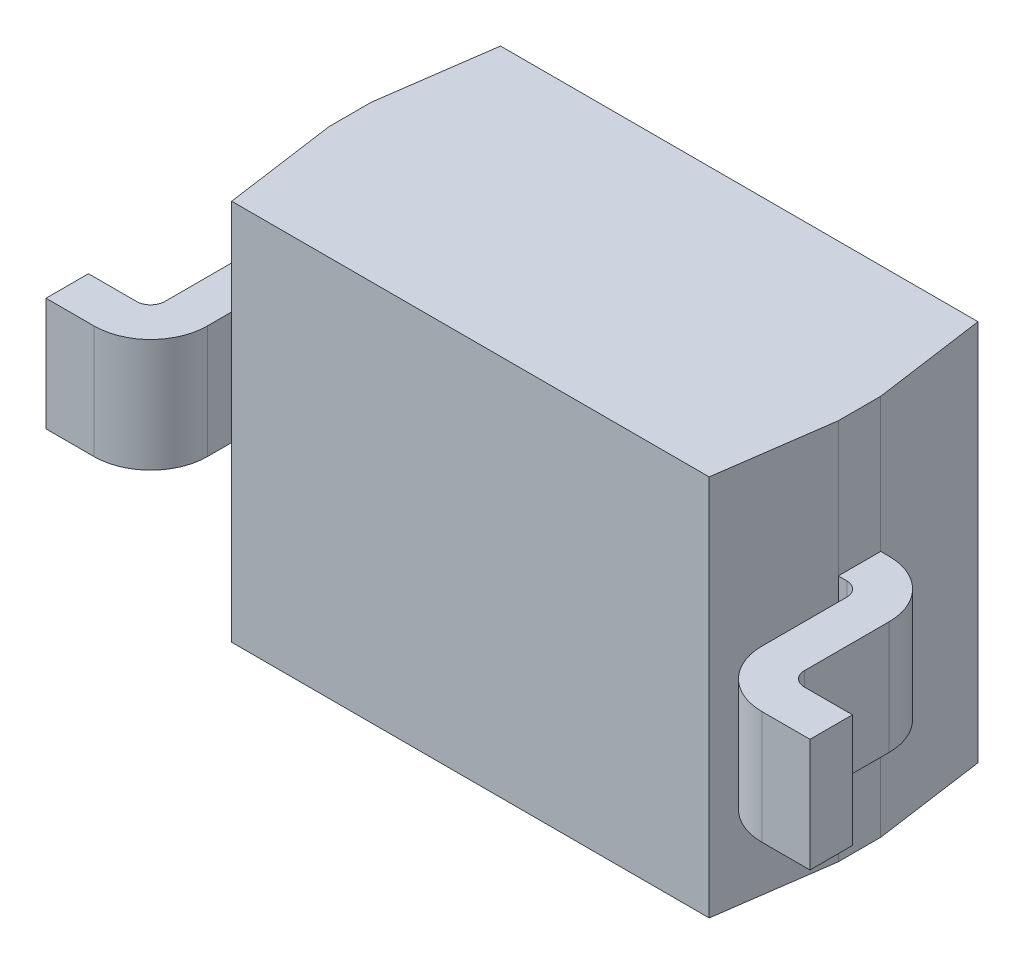
ISO-10303-21;
HEADER;
FILE_DESCRIPTION(('STEP AP214'),'2;1');
FILE_NAME('part.step','',(''),(''),'','','');
FILE_SCHEMA(('AUTOMOTIVE_DESIGN { 1 0 10303 214 1 1 1 1 }'));
ENDSEC;
DATA;
#1=APPLICATION_CONTEXT('core data for automotive mechanical design processes');
#2=APPLICATION_PROTOCOL_DEFINITION('international standard','automotive_design',2000,#1);
#3=PRODUCT_CONTEXT('',#1,'mechanical');
#4=PRODUCT('Part','Part','',(#3));
#5=PRODUCT_RELATED_PRODUCT_CATEGORY('part','',(#4));
#6=PRODUCT_DEFINITION_FORMATION('','',#4);
#7=PRODUCT_DEFINITION_CONTEXT('part definition',#1,'design');
#8=PRODUCT_DEFINITION('design','',#6,#7);
#9=PRODUCT_DEFINITION_SHAPE('','',#8);
#10=(LENGTH_UNIT() NAMED_UNIT(*) SI_UNIT(.MILLI.,.METRE.));
#11=(NAMED_UNIT(*) PLANE_ANGLE_UNIT() SI_UNIT($,.RADIAN.));
#12=(NAMED_UNIT(*) SI_UNIT($,.STERADIAN.) SOLID_ANGLE_UNIT());
#13=UNCERTAINTY_MEASURE_WITH_UNIT(LENGTH_MEASURE(1.E-05),#10,'distance_accuracy_value','');
#14=(GEOMETRIC_REPRESENTATION_CONTEXT(3) GLOBAL_UNCERTAINTY_ASSIGNED_CONTEXT((#13)) GLOBAL_UNIT_ASSIGNED_CONTEXT((#10,
#11,#12)) REPRESENTATION_CONTEXT('',''));
#15=CARTESIAN_POINT('',(0.,0.,0.));
#16=DIRECTION('',(0.,0.,1.));
#17=DIRECTION('',(1.,0.,0.));
#18=AXIS2_PLACEMENT_3D('',#15,#16,#17);
#19=CARTESIAN_POINT('',(0.871891833059522,0.,-0.9));
#20=DIRECTION('',(0.99026806874157,0.,-0.139173100960065));
#21=DIRECTION('',(0.,-1.,0.));
#22=AXIS2_PLACEMENT_3D('',#19,#20,#21);
#23=PLANE('',#22);
#24=DIRECTION('',(-0.139173100960065,0.,-0.99026806874157));
#25=VECTOR('',#24,1.);
#26=CARTESIAN_POINT('',(0.882397998537451,0.675,-0.825244748259981));
#27=LINE('',#26,#25);
#28=CARTESIAN_POINT('',(0.9,0.675,-0.7));
#29=VERTEX_POINT('',#28);
#30=CARTESIAN_POINT('',(0.843783666119044,0.675,-1.1));
#31=VERTEX_POINT('',#30);
#32=EDGE_CURVE('E58',#29,#31,#27,.T.);
#33=ORIENTED_EDGE('',*,*,#32,.F.);
#34=DIRECTION('',(0.,1.,0.));
#35=VECTOR('',#34,1.);
#36=CARTESIAN_POINT('',(0.9,0.,-0.7));
#37=LINE('',#36,#35);
#38=CARTESIAN_POINT('',(0.9,0.2,-0.7));
#39=VERTEX_POINT('',#38);
#40=EDGE_CURVE('E338',#39,#29,#37,.T.);
#41=ORIENTED_EDGE('',*,*,#40,.F.);
#42=DIRECTION('',(0.,1.,0.));
#43=VECTOR('',#42,1.);
#44=CARTESIAN_POINT('',(0.9,0.,-0.7));
#45=LINE('',#44,#43);
#46=CARTESIAN_POINT('',(0.9,-0.2,-0.7));
#47=VERTEX_POINT('',#46);
#48=EDGE_CURVE('E513',#47,#39,#45,.T.);
#49=ORIENTED_EDGE('',*,*,#48,.F.);
#50=DIRECTION('',(0.,1.,0.));
#51=VECTOR('',#50,1.);
#52=CARTESIAN_POINT('',(0.9,0.,-0.7));
#53=LINE('',#52,#51);
#54=CARTESIAN_POINT('',(0.9,-0.675,-0.7));
#55=VERTEX_POINT('',#54);
#56=EDGE_CURVE('E348',#55,#47,#53,.T.);
#57=ORIENTED_EDGE('',*,*,#56,.F.);
#58=DIRECTION('',(0.139173100960065,0.,0.99026806874157));
#59=VECTOR('',#58,1.);
#60=CARTESIAN_POINT('',(0.882397998537451,-0.675,-0.825244748259981));
#61=LINE('',#60,#59);
#62=CARTESIAN_POINT('',(0.843783666119044,-0.675,-1.1));
#63=VERTEX_POINT('',#62);
#64=EDGE_CURVE('E540',#63,#55,#61,.T.);
#65=ORIENTED_EDGE('',*,*,#64,.F.);
#66=DIRECTION('',(0.,-1.,0.));
#67=VECTOR('',#66,1.);
#68=CARTESIAN_POINT('',(0.843783666119044,0.,-1.1));
#69=LINE('',#68,#67);
#70=EDGE_CURVE('E11',#31,#63,#69,.T.);
#71=ORIENTED_EDGE('',*,*,#70,.F.);
#72=EDGE_LOOP('',(#33,#41,#49,#57,#65,#71));
#73=FACE_BOUND('',#72,.T.);
#74=ADVANCED_FACE('F47',(#73),#23,.T.);
#75=CARTESIAN_POINT('',(0.,0.,-1.1));
#76=DIRECTION('',(0.,0.,1.));
#77=DIRECTION('',(0.,-1.,0.));
#78=AXIS2_PLACEMENT_3D('',#75,#76,#77);
#79=PLANE('',#78);
#80=DIRECTION('',(0.,1.,0.));
#81=VECTOR('',#80,1.);
#82=CARTESIAN_POINT('',(-0.843783666119043,0.,-1.1));
#83=LINE('',#82,#81);
#84=CARTESIAN_POINT('',(-0.843783666119043,-0.675,-1.1));
#85=VERTEX_POINT('',#84);
#86=CARTESIAN_POINT('',(-0.843783666119043,0.675,-1.1));
#87=VERTEX_POINT('',#86);
#88=EDGE_CURVE('E450',#85,#87,#83,.T.);
#89=ORIENTED_EDGE('',*,*,#88,.T.);
#90=DIRECTION('',(1.,0.,0.));
#91=VECTOR('',#90,1.);
#92=CARTESIAN_POINT('',(0.,0.675,-1.1));
#93=LINE('',#92,#91);
#94=EDGE_CURVE('E70',#87,#31,#93,.T.);
#95=ORIENTED_EDGE('',*,*,#94,.T.);
#96=ORIENTED_EDGE('',*,*,#70,.T.);
#97=DIRECTION('',(-1.,0.,0.));
#98=VECTOR('',#97,1.);
#99=CARTESIAN_POINT('',(0.,-0.675,-1.1));
#100=LINE('',#99,#98);
#101=EDGE_CURVE('E462',#63,#85,#100,.T.);
#102=ORIENTED_EDGE('',*,*,#101,.T.);
#103=EDGE_LOOP('',(#89,#95,#96,#102));
#104=FACE_BOUND('',#103,.T.);
#105=ADVANCED_FACE('F726',(#104),#79,.F.);
#106=CARTESIAN_POINT('',(0.,0.675,-0.625));
#107=DIRECTION('',(0.,-1.,0.));
#108=DIRECTION('',(-1.,0.,0.));
#109=AXIS2_PLACEMENT_3D('',#106,#107,#108);
#110=PLANE('',#109);
#111=DIRECTION('',(0.139173100960065,0.,0.99026806874157));
#112=VECTOR('',#111,1.);
#113=CARTESIAN_POINT('',(-0.882397998537451,0.675,-0.424755251740019));
#114=LINE('',#113,#112);
#115=CARTESIAN_POINT('',(-0.9,0.675,-0.55));
#116=VERTEX_POINT('',#115);
#117=CARTESIAN_POINT('',(-0.843783666119043,0.675,-0.15));
#118=VERTEX_POINT('',#117);
#119=EDGE_CURVE('E314',#116,#118,#114,.T.);
#120=ORIENTED_EDGE('',*,*,#119,.T.);
#121=DIRECTION('',(-1.,0.,0.));
#122=VECTOR('',#121,1.);
#123=CARTESIAN_POINT('',(0.,0.675,-0.15));
#124=LINE('',#123,#122);
#125=CARTESIAN_POINT('',(0.843783666119044,0.675,-0.15));
#126=VERTEX_POINT('',#125);
#127=EDGE_CURVE('E322',#126,#118,#124,.T.);
#128=ORIENTED_EDGE('',*,*,#127,.F.);
#129=DIRECTION('',(0.139173100960065,0.,-0.99026806874157));
#130=VECTOR('',#129,1.);
#131=CARTESIAN_POINT('',(0.882397998537451,0.675,-0.424755251740019));
#132=LINE('',#131,#130);
#133=CARTESIAN_POINT('',(0.9,0.675,-0.55));
#134=VERTEX_POINT('',#133);
#135=EDGE_CURVE('E451',#126,#134,#132,.T.);
#136=ORIENTED_EDGE('',*,*,#135,.T.);
#137=DIRECTION('',(0.,0.,1.));
#138=VECTOR('',#137,1.);
#139=CARTESIAN_POINT('',(0.9,0.675,-0.625));
#140=LINE('',#139,#138);
#141=EDGE_CURVE('E344',#29,#134,#140,.T.);
#142=ORIENTED_EDGE('',*,*,#141,.F.);
#143=ORIENTED_EDGE('',*,*,#32,.T.);
#144=ORIENTED_EDGE('',*,*,#94,.F.);
#145=DIRECTION('',(-0.139173100960065,0.,0.99026806874157));
#146=VECTOR('',#145,1.);
#147=CARTESIAN_POINT('',(-0.882397998537451,0.675,-0.825244748259981));
#148=LINE('',#147,#146);
#149=CARTESIAN_POINT('',(-0.9,0.675,-0.7));
#150=VERTEX_POINT('',#149);
#151=EDGE_CURVE('E447',#87,#150,#148,.T.);
#152=ORIENTED_EDGE('',*,*,#151,.T.);
#153=DIRECTION('',(0.,0.,-1.));
#154=VECTOR('',#153,1.);
#155=CARTESIAN_POINT('',(-0.9,0.675,-0.625));
#156=LINE('',#155,#154);
#157=EDGE_CURVE('E336',#116,#150,#156,.T.);
#158=ORIENTED_EDGE('',*,*,#157,.F.);
#159=EDGE_LOOP('',(#120,#128,#136,#142,#143,#144,#152,#158));
#160=FACE_BOUND('',#159,.T.);
#161=ADVANCED_FACE('F333',(#160),#110,.F.);
#162=CARTESIAN_POINT('',(-0.871891833059522,0.,-0.9));
#163=DIRECTION('',(-0.99026806874157,0.,-0.139173100960065));
#164=DIRECTION('',(0.,1.,0.));
#165=AXIS2_PLACEMENT_3D('',#162,#163,#164);
#166=PLANE('',#165);
#167=ORIENTED_EDGE('',*,*,#151,.F.);
#168=ORIENTED_EDGE('',*,*,#88,.F.);
#169=DIRECTION('',(0.139173100960065,0.,-0.99026806874157));
#170=VECTOR('',#169,1.);
#171=CARTESIAN_POINT('',(-0.882397998537451,-0.675,-0.825244748259982));
#172=LINE('',#171,#170);
#173=CARTESIAN_POINT('',(-0.9,-0.675,-0.7));
#174=VERTEX_POINT('',#173);
#175=EDGE_CURVE('E330',#174,#85,#172,.T.);
#176=ORIENTED_EDGE('',*,*,#175,.F.);
#177=DIRECTION('',(0.,-1.,0.));
#178=VECTOR('',#177,1.);
#179=CARTESIAN_POINT('',(-0.9,0.,-0.7));
#180=LINE('',#179,#178);
#181=CARTESIAN_POINT('',(-0.9,-0.2,-0.7));
#182=VERTEX_POINT('',#181);
#183=EDGE_CURVE('E371',#182,#174,#180,.T.);
#184=ORIENTED_EDGE('',*,*,#183,.F.);
#185=DIRECTION('',(0.,-1.,0.));
#186=VECTOR('',#185,1.);
#187=CARTESIAN_POINT('',(-0.9,0.,-0.7));
#188=LINE('',#187,#186);
#189=CARTESIAN_POINT('',(-0.9,0.2,-0.7));
#190=VERTEX_POINT('',#189);
#191=EDGE_CURVE('E394',#190,#182,#188,.T.);
#192=ORIENTED_EDGE('',*,*,#191,.F.);
#193=DIRECTION('',(0.,-1.,0.));
#194=VECTOR('',#193,1.);
#195=CARTESIAN_POINT('',(-0.9,0.,-0.7));
#196=LINE('',#195,#194);
#197=EDGE_CURVE('E603',#150,#190,#196,.T.);
#198=ORIENTED_EDGE('',*,*,#197,.F.);
#199=EDGE_LOOP('',(#167,#168,#176,#184,#192,#198));
#200=FACE_BOUND('',#199,.T.);
#201=ADVANCED_FACE('F784',(#200),#166,.T.);
#202=CARTESIAN_POINT('',(0.871891833059522,0.,-0.35));
#203=DIRECTION('',(0.99026806874157,0.,0.139173100960065));
#204=DIRECTION('',(0.,-1.,0.));
#205=AXIS2_PLACEMENT_3D('',#202,#203,#204);
#206=PLANE('',#205);
#207=ORIENTED_EDGE('',*,*,#135,.F.);
#208=DIRECTION('',(0.,1.,0.));
#209=VECTOR('',#208,1.);
#210=CARTESIAN_POINT('',(0.843783666119044,0.,-0.15));
#211=LINE('',#210,#209);
#212=CARTESIAN_POINT('',(0.843783666119044,-0.675,-0.15));
#213=VERTEX_POINT('',#212);
#214=EDGE_CURVE('E325',#213,#126,#211,.T.);
#215=ORIENTED_EDGE('',*,*,#214,.F.);
#216=DIRECTION('',(-0.139173100960065,0.,0.99026806874157));
#217=VECTOR('',#216,1.);
#218=CARTESIAN_POINT('',(0.882397998537451,-0.675,-0.424755251740019));
#219=LINE('',#218,#217);
#220=CARTESIAN_POINT('',(0.9,-0.675,-0.55));
#221=VERTEX_POINT('',#220);
#222=EDGE_CURVE('E475',#221,#213,#219,.T.);
#223=ORIENTED_EDGE('',*,*,#222,.F.);
#224=DIRECTION('',(0.,-1.,0.));
#225=VECTOR('',#224,1.);
#226=CARTESIAN_POINT('',(0.9,0.,-0.55));
#227=LINE('',#226,#225);
#228=CARTESIAN_POINT('',(0.9,-0.2,-0.55));
#229=VERTEX_POINT('',#228);
#230=EDGE_CURVE('E472',#229,#221,#227,.T.);
#231=ORIENTED_EDGE('',*,*,#230,.F.);
#232=DIRECTION('',(0.,-1.,0.));
#233=VECTOR('',#232,1.);
#234=CARTESIAN_POINT('',(0.9,0.,-0.55));
#235=LINE('',#234,#233);
#236=CARTESIAN_POINT('',(0.9,0.2,-0.55));
#237=VERTEX_POINT('',#236);
#238=EDGE_CURVE('E359',#237,#229,#235,.T.);
#239=ORIENTED_EDGE('',*,*,#238,.F.);
#240=DIRECTION('',(0.,-1.,0.));
#241=VECTOR('',#240,1.);
#242=CARTESIAN_POINT('',(0.9,0.,-0.55));
#243=LINE('',#242,#241);
#244=EDGE_CURVE('E468',#134,#237,#243,.T.);
#245=ORIENTED_EDGE('',*,*,#244,.F.);
#246=EDGE_LOOP('',(#207,#215,#223,#231,#239,#245));
#247=FACE_BOUND('',#246,.T.);
#248=ADVANCED_FACE('F690',(#247),#206,.T.);
#249=CARTESIAN_POINT('',(0.,0.,-0.15));
#250=DIRECTION('',(0.,0.,-1.));
#251=DIRECTION('',(0.,-1.,0.));
#252=AXIS2_PLACEMENT_3D('',#249,#250,#251);
#253=PLANE('',#252);
#254=DIRECTION('',(0.,-1.,0.));
#255=VECTOR('',#254,1.);
#256=CARTESIAN_POINT('',(-0.843783666119043,0.,-0.15));
#257=LINE('',#256,#255);
#258=CARTESIAN_POINT('',(-0.843783666119043,-0.675,-0.15));
#259=VERTEX_POINT('',#258);
#260=EDGE_CURVE('E309',#118,#259,#257,.T.);
#261=ORIENTED_EDGE('',*,*,#260,.T.);
#262=DIRECTION('',(1.,0.,0.));
#263=VECTOR('',#262,1.);
#264=CARTESIAN_POINT('',(0.,-0.675,-0.15));
#265=LINE('',#264,#263);
#266=EDGE_CURVE('E473',#259,#213,#265,.T.);
#267=ORIENTED_EDGE('',*,*,#266,.T.);
#268=ORIENTED_EDGE('',*,*,#214,.T.);
#269=ORIENTED_EDGE('',*,*,#127,.T.);
#270=EDGE_LOOP('',(#261,#267,#268,#269));
#271=FACE_BOUND('',#270,.T.);
#272=ADVANCED_FACE('F323',(#271),#253,.F.);
#273=CARTESIAN_POINT('',(0.,-0.675,-0.625));
#274=DIRECTION('',(0.,-1.,0.));
#275=DIRECTION('',(-1.,0.,0.));
#276=AXIS2_PLACEMENT_3D('',#273,#274,#275);
#277=PLANE('',#276);
#278=DIRECTION('',(-0.139173100960065,0.,-0.99026806874157));
#279=VECTOR('',#278,1.);
#280=CARTESIAN_POINT('',(-0.882397998537451,-0.675,-0.424755251740019));
#281=LINE('',#280,#279);
#282=CARTESIAN_POINT('',(-0.9,-0.675,-0.55));
#283=VERTEX_POINT('',#282);
#284=EDGE_CURVE('E316',#259,#283,#281,.T.);
#285=ORIENTED_EDGE('',*,*,#284,.T.);
#286=DIRECTION('',(0.,0.,1.));
#287=VECTOR('',#286,1.);
#288=CARTESIAN_POINT('',(-0.9,-0.675,-0.625));
#289=LINE('',#288,#287);
#290=EDGE_CURVE('E367',#174,#283,#289,.T.);
#291=ORIENTED_EDGE('',*,*,#290,.F.);
#292=ORIENTED_EDGE('',*,*,#175,.T.);
#293=ORIENTED_EDGE('',*,*,#101,.F.);
#294=ORIENTED_EDGE('',*,*,#64,.T.);
#295=DIRECTION('',(0.,0.,-1.));
#296=VECTOR('',#295,1.);
#297=CARTESIAN_POINT('',(0.9,-0.675,-0.625));
#298=LINE('',#297,#296);
#299=EDGE_CURVE('E525',#221,#55,#298,.T.);
#300=ORIENTED_EDGE('',*,*,#299,.F.);
#301=ORIENTED_EDGE('',*,*,#222,.T.);
#302=ORIENTED_EDGE('',*,*,#266,.F.);
#303=EDGE_LOOP('',(#285,#291,#292,#293,#294,#300,#301,#302));
#304=FACE_BOUND('',#303,.T.);
#305=ADVANCED_FACE('F686',(#304),#277,.T.);
#306=CARTESIAN_POINT('',(-0.871891833059522,0.,-0.35));
#307=DIRECTION('',(-0.99026806874157,0.,0.139173100960065));
#308=DIRECTION('',(-0.139173100960065,0.,-0.99026806874157));
#309=AXIS2_PLACEMENT_3D('',#306,#307,#308);
#310=PLANE('',#309);
#311=ORIENTED_EDGE('',*,*,#119,.F.);
#312=DIRECTION('',(0.,1.,0.));
#313=VECTOR('',#312,1.);
#314=CARTESIAN_POINT('',(-0.9,0.,-0.55));
#315=LINE('',#314,#313);
#316=CARTESIAN_POINT('',(-0.9,0.2,-0.55));
#317=VERTEX_POINT('',#316);
#318=EDGE_CURVE('E572',#317,#116,#315,.T.);
#319=ORIENTED_EDGE('',*,*,#318,.F.);
#320=DIRECTION('',(0.,1.,0.));
#321=VECTOR('',#320,1.);
#322=CARTESIAN_POINT('',(-0.9,0.,-0.55));
#323=LINE('',#322,#321);
#324=CARTESIAN_POINT('',(-0.9,-0.2,-0.55));
#325=VERTEX_POINT('',#324);
#326=EDGE_CURVE('E446',#325,#317,#323,.T.);
#327=ORIENTED_EDGE('',*,*,#326,.F.);
#328=DIRECTION('',(0.,1.,0.));
#329=VECTOR('',#328,1.);
#330=CARTESIAN_POINT('',(-0.9,0.,-0.55));
#331=LINE('',#330,#329);
#332=EDGE_CURVE('E372',#283,#325,#331,.T.);
#333=ORIENTED_EDGE('',*,*,#332,.F.);
#334=ORIENTED_EDGE('',*,*,#284,.F.);
#335=ORIENTED_EDGE('',*,*,#260,.F.);
#336=EDGE_LOOP('',(#311,#319,#327,#333,#334,#335));
#337=FACE_BOUND('',#336,.T.);
#338=ADVANCED_FACE('F311',(#337),#310,.T.);
#339=CARTESIAN_POINT('',(0.9,0.,-0.625));
#340=DIRECTION('',(-1.,0.,0.));
#341=DIRECTION('',(0.,0.,-1.));
#342=AXIS2_PLACEMENT_3D('',#339,#340,#341);
#343=PLANE('',#342);
#344=DIRECTION('',(0.,0.,1.));
#345=VECTOR('',#344,1.);
#346=CARTESIAN_POINT('',(0.9,0.2,-0.6625));
#347=LINE('',#346,#345);
#348=EDGE_CURVE('E480',#39,#237,#347,.T.);
#349=ORIENTED_EDGE('',*,*,#348,.F.);
#350=ORIENTED_EDGE('',*,*,#40,.T.);
#351=ORIENTED_EDGE('',*,*,#141,.T.);
#352=ORIENTED_EDGE('',*,*,#244,.T.);
#353=EDGE_LOOP('',(#349,#350,#351,#352));
#354=FACE_BOUND('',#353,.T.);
#355=ADVANCED_FACE('F753',(#354),#343,.F.);
#356=CARTESIAN_POINT('',(0.9,0.,-0.625));
#357=DIRECTION('',(-1.,0.,0.));
#358=DIRECTION('',(0.,0.,-1.));
#359=AXIS2_PLACEMENT_3D('',#356,#357,#358);
#360=PLANE('',#359);
#361=DIRECTION('',(0.,0.,-1.));
#362=VECTOR('',#361,1.);
#363=CARTESIAN_POINT('',(0.9,-0.2,-0.6625));
#364=LINE('',#363,#362);
#365=EDGE_CURVE('E502',#229,#47,#364,.T.);
#366=ORIENTED_EDGE('',*,*,#365,.F.);
#367=ORIENTED_EDGE('',*,*,#230,.T.);
#368=ORIENTED_EDGE('',*,*,#299,.T.);
#369=ORIENTED_EDGE('',*,*,#56,.T.);
#370=EDGE_LOOP('',(#366,#367,#368,#369));
#371=FACE_BOUND('',#370,.T.);
#372=ADVANCED_FACE('F755',(#371),#360,.F.);
#373=CARTESIAN_POINT('',(0.9,-0.2,-0.7));
#374=DIRECTION('',(0.,1.,0.));
#375=DIRECTION('',(0.,0.,1.));
#376=AXIS2_PLACEMENT_3D('',#373,#374,#375);
#377=PLANE('',#376);
#378=ORIENTED_EDGE('',*,*,#365,.T.);
#379=DIRECTION('',(-1.,0.,0.));
#380=VECTOR('',#379,1.);
#381=CARTESIAN_POINT('',(0.9,-0.2,-0.7));
#382=LINE('',#381,#380);
#383=CARTESIAN_POINT('',(0.93,-0.2,-0.7));
#384=VERTEX_POINT('',#383);
#385=EDGE_CURVE('E419',#384,#47,#382,.T.);
#386=ORIENTED_EDGE('',*,*,#385,.F.);
#387=CARTESIAN_POINT('',(0.93,-0.2,-0.5));
#388=DIRECTION('',(0.,1.,0.));
#389=DIRECTION('',(1.,0.,0.));
#390=AXIS2_PLACEMENT_3D('',#387,#388,#389);
#391=CIRCLE('',#390,0.2);
#392=CARTESIAN_POINT('',(1.13,-0.2,-0.5));
#393=VERTEX_POINT('',#392);
#394=EDGE_CURVE('E373',#393,#384,#391,.T.);
#395=ORIENTED_EDGE('',*,*,#394,.F.);
#396=DIRECTION('',(0.,0.,-1.));
#397=VECTOR('',#396,1.);
#398=CARTESIAN_POINT('',(1.13,-0.2,-0.5));
#399=LINE('',#398,#397);
#400=CARTESIAN_POINT('',(1.13,-0.2,-0.2));
#401=VERTEX_POINT('',#400);
#402=EDGE_CURVE('E532',#401,#393,#399,.T.);
#403=ORIENTED_EDGE('',*,*,#402,.F.);
#404=CARTESIAN_POINT('',(1.18,-0.2,-0.2));
#405=DIRECTION('',(0.,-1.,0.));
#406=DIRECTION('',(1.,0.,0.));
#407=AXIS2_PLACEMENT_3D('',#404,#405,#406);
#408=CIRCLE('',#407,0.05);
#409=CARTESIAN_POINT('',(1.18,-0.2,-0.15));
#410=VERTEX_POINT('',#409);
#411=EDGE_CURVE('E463',#410,#401,#408,.T.);
#412=ORIENTED_EDGE('',*,*,#411,.F.);
#413=DIRECTION('',(-1.,0.,0.));
#414=VECTOR('',#413,1.);
#415=CARTESIAN_POINT('',(1.18,-0.2,-0.15));
#416=LINE('',#415,#414);
#417=CARTESIAN_POINT('',(1.35,-0.2,-0.15));
#418=VERTEX_POINT('',#417);
#419=EDGE_CURVE('E350',#418,#410,#416,.T.);
#420=ORIENTED_EDGE('',*,*,#419,.F.);
#421=DIRECTION('',(0.,0.,-1.));
#422=VECTOR('',#421,1.);
#423=CARTESIAN_POINT('',(1.35,-0.2,-0.15));
#424=LINE('',#423,#422);
#425=CARTESIAN_POINT('',(1.35,-0.2,0.));
#426=VERTEX_POINT('',#425);
#427=EDGE_CURVE('E366',#426,#418,#424,.T.);
#428=ORIENTED_EDGE('',*,*,#427,.F.);
#429=DIRECTION('',(1.,0.,0.));
#430=VECTOR('',#429,1.);
#431=CARTESIAN_POINT('',(1.35,-0.2,0.));
#432=LINE('',#431,#430);
#433=CARTESIAN_POINT('',(1.18,-0.2,0.));
#434=VERTEX_POINT('',#433);
#435=EDGE_CURVE('E576',#434,#426,#432,.T.);
#436=ORIENTED_EDGE('',*,*,#435,.F.);
#437=CARTESIAN_POINT('',(1.18,-0.2,-0.2));
#438=DIRECTION('',(0.,1.,0.));
#439=DIRECTION('',(1.,0.,0.));
#440=AXIS2_PLACEMENT_3D('',#437,#438,#439);
#441=CIRCLE('',#440,0.2);
#442=CARTESIAN_POINT('',(0.98,-0.2,-0.2));
#443=VERTEX_POINT('',#442);
#444=EDGE_CURVE('E560',#443,#434,#441,.T.);
#445=ORIENTED_EDGE('',*,*,#444,.F.);
#446=DIRECTION('',(0.,0.,1.));
#447=VECTOR('',#446,1.);
#448=CARTESIAN_POINT('',(0.98,-0.2,-0.2));
#449=LINE('',#448,#447);
#450=CARTESIAN_POINT('',(0.98,-0.2,-0.5));
#451=VERTEX_POINT('',#450);
#452=EDGE_CURVE('E443',#451,#443,#449,.T.);
#453=ORIENTED_EDGE('',*,*,#452,.F.);
#454=CARTESIAN_POINT('',(0.93,-0.2,-0.5));
#455=DIRECTION('',(0.,-1.,0.));
#456=DIRECTION('',(1.,0.,0.));
#457=AXIS2_PLACEMENT_3D('',#454,#455,#456);
#458=CIRCLE('',#457,0.05);
#459=CARTESIAN_POINT('',(0.93,-0.2,-0.55));
#460=VERTEX_POINT('',#459);
#461=EDGE_CURVE('E485',#460,#451,#458,.T.);
#462=ORIENTED_EDGE('',*,*,#461,.F.);
#463=DIRECTION('',(1.,0.,0.));
#464=VECTOR('',#463,1.);
#465=CARTESIAN_POINT('',(0.93,-0.2,-0.55));
#466=LINE('',#465,#464);
#467=EDGE_CURVE('E356',#229,#460,#466,.T.);
#468=ORIENTED_EDGE('',*,*,#467,.F.);
#469=EDGE_LOOP('',(#378,#386,#395,#403,#412,#420,#428,#436,#445,#453,#462,#468));
#470=FACE_BOUND('',#469,.T.);
#471=ADVANCED_FACE('F796',(#470),#377,.F.);
#472=CARTESIAN_POINT('',(0.9,0.2,-0.7));
#473=DIRECTION('',(0.,1.,0.));
#474=DIRECTION('',(0.,0.,1.));
#475=AXIS2_PLACEMENT_3D('',#472,#473,#474);
#476=PLANE('',#475);
#477=ORIENTED_EDGE('',*,*,#348,.T.);
#478=DIRECTION('',(-1.,0.,0.));
#479=VECTOR('',#478,1.);
#480=CARTESIAN_POINT('',(0.93,0.2,-0.55));
#481=LINE('',#480,#479);
#482=CARTESIAN_POINT('',(0.93,0.2,-0.55));
#483=VERTEX_POINT('',#482);
#484=EDGE_CURVE('E360',#483,#237,#481,.T.);
#485=ORIENTED_EDGE('',*,*,#484,.F.);
#486=CARTESIAN_POINT('',(0.93,0.2,-0.5));
#487=DIRECTION('',(0.,1.,0.));
#488=DIRECTION('',(1.,0.,0.));
#489=AXIS2_PLACEMENT_3D('',#486,#487,#488);
#490=CIRCLE('',#489,0.05);
#491=CARTESIAN_POINT('',(0.98,0.2,-0.5));
#492=VERTEX_POINT('',#491);
#493=EDGE_CURVE('E442',#492,#483,#490,.T.);
#494=ORIENTED_EDGE('',*,*,#493,.F.);
#495=DIRECTION('',(0.,0.,-1.));
#496=VECTOR('',#495,1.);
#497=CARTESIAN_POINT('',(0.98,0.2,-0.2));
#498=LINE('',#497,#496);
#499=CARTESIAN_POINT('',(0.98,0.2,-0.2));
#500=VERTEX_POINT('',#499);
#501=EDGE_CURVE('E623',#500,#492,#498,.T.);
#502=ORIENTED_EDGE('',*,*,#501,.F.);
#503=CARTESIAN_POINT('',(1.18,0.2,-0.2));
#504=DIRECTION('',(0.,-1.,0.));
#505=DIRECTION('',(1.,0.,0.));
#506=AXIS2_PLACEMENT_3D('',#503,#504,#505);
#507=CIRCLE('',#506,0.2);
#508=CARTESIAN_POINT('',(1.18,0.2,0.));
#509=VERTEX_POINT('',#508);
#510=EDGE_CURVE('E565',#509,#500,#507,.T.);
#511=ORIENTED_EDGE('',*,*,#510,.F.);
#512=DIRECTION('',(-1.,0.,0.));
#513=VECTOR('',#512,1.);
#514=CARTESIAN_POINT('',(1.35,0.2,0.));
#515=LINE('',#514,#513);
#516=CARTESIAN_POINT('',(1.35,0.2,0.));
#517=VERTEX_POINT('',#516);
#518=EDGE_CURVE('E586',#517,#509,#515,.T.);
#519=ORIENTED_EDGE('',*,*,#518,.F.);
#520=DIRECTION('',(0.,0.,1.));
#521=VECTOR('',#520,1.);
#522=CARTESIAN_POINT('',(1.35,0.2,-0.15));
#523=LINE('',#522,#521);
#524=CARTESIAN_POINT('',(1.35,0.2,-0.15));
#525=VERTEX_POINT('',#524);
#526=EDGE_CURVE('E362',#525,#517,#523,.T.);
#527=ORIENTED_EDGE('',*,*,#526,.F.);
#528=DIRECTION('',(1.,0.,0.));
#529=VECTOR('',#528,1.);
#530=CARTESIAN_POINT('',(1.18,0.2,-0.15));
#531=LINE('',#530,#529);
#532=CARTESIAN_POINT('',(1.18,0.2,-0.15));
#533=VERTEX_POINT('',#532);
#534=EDGE_CURVE('E355',#533,#525,#531,.T.);
#535=ORIENTED_EDGE('',*,*,#534,.F.);
#536=CARTESIAN_POINT('',(1.18,0.2,-0.2));
#537=DIRECTION('',(0.,1.,0.));
#538=DIRECTION('',(1.,0.,0.));
#539=AXIS2_PLACEMENT_3D('',#536,#537,#538);
#540=CIRCLE('',#539,0.05);
#541=CARTESIAN_POINT('',(1.13,0.2,-0.2));
#542=VERTEX_POINT('',#541);
#543=EDGE_CURVE('E467',#542,#533,#540,.T.);
#544=ORIENTED_EDGE('',*,*,#543,.F.);
#545=DIRECTION('',(0.,0.,1.));
#546=VECTOR('',#545,1.);
#547=CARTESIAN_POINT('',(1.13,0.2,-0.5));
#548=LINE('',#547,#546);
#549=CARTESIAN_POINT('',(1.13,0.2,-0.5));
#550=VERTEX_POINT('',#549);
#551=EDGE_CURVE('E524',#550,#542,#548,.T.);
#552=ORIENTED_EDGE('',*,*,#551,.F.);
#553=CARTESIAN_POINT('',(0.93,0.2,-0.5));
#554=DIRECTION('',(0.,-1.,0.));
#555=DIRECTION('',(1.,0.,0.));
#556=AXIS2_PLACEMENT_3D('',#553,#554,#555);
#557=CIRCLE('',#556,0.2);
#558=CARTESIAN_POINT('',(0.93,0.2,-0.7));
#559=VERTEX_POINT('',#558);
#560=EDGE_CURVE('E378',#559,#550,#557,.T.);
#561=ORIENTED_EDGE('',*,*,#560,.F.);
#562=DIRECTION('',(1.,0.,0.));
#563=VECTOR('',#562,1.);
#564=CARTESIAN_POINT('',(0.9,0.2,-0.7));
#565=LINE('',#564,#563);
#566=EDGE_CURVE('E510',#39,#559,#565,.T.);
#567=ORIENTED_EDGE('',*,*,#566,.F.);
#568=EDGE_LOOP('',(#477,#485,#494,#502,#511,#519,#527,#535,#544,#552,#561,#567));
#569=FACE_BOUND('',#568,.T.);
#570=ADVANCED_FACE('F799',(#569),#476,.T.);
#571=CARTESIAN_POINT('',(0.9,0.2,-0.55));
#572=DIRECTION('',(0.,0.,1.));
#573=DIRECTION('',(0.,-1.,0.));
#574=AXIS2_PLACEMENT_3D('',#571,#572,#573);
#575=PLANE('',#574);
#576=ORIENTED_EDGE('',*,*,#484,.T.);
#577=ORIENTED_EDGE('',*,*,#238,.T.);
#578=ORIENTED_EDGE('',*,*,#467,.T.);
#579=DIRECTION('',(0.,-1.,0.));
#580=VECTOR('',#579,1.);
#581=CARTESIAN_POINT('',(0.93,0.2,-0.55));
#582=LINE('',#581,#580);
#583=EDGE_CURVE('E489',#483,#460,#582,.T.);
#584=ORIENTED_EDGE('',*,*,#583,.F.);
#585=EDGE_LOOP('',(#576,#577,#578,#584));
#586=FACE_BOUND('',#585,.T.);
#587=ADVANCED_FACE('F780',(#586),#575,.T.);
#588=CARTESIAN_POINT('',(0.93,0.2,-0.5));
#589=DIRECTION('',(0.,-1.,0.));
#590=DIRECTION('',(1.,0.,0.));
#591=AXIS2_PLACEMENT_3D('',#588,#589,#590);
#592=CYLINDRICAL_SURFACE('',#591,0.05);
#593=ORIENTED_EDGE('',*,*,#493,.T.);
#594=ORIENTED_EDGE('',*,*,#583,.T.);
#595=ORIENTED_EDGE('',*,*,#461,.T.);
#596=DIRECTION('',(0.,-1.,0.));
#597=VECTOR('',#596,1.);
#598=CARTESIAN_POINT('',(0.98,0.2,-0.5));
#599=LINE('',#598,#597);
#600=EDGE_CURVE('E438',#492,#451,#599,.T.);
#601=ORIENTED_EDGE('',*,*,#600,.F.);
#602=EDGE_LOOP('',(#593,#594,#595,#601));
#603=FACE_BOUND('',#602,.T.);
#604=ADVANCED_FACE('F763',(#603),#592,.F.);
#605=CARTESIAN_POINT('',(0.98,0.2,-0.5));
#606=DIRECTION('',(-1.,0.,0.));
#607=DIRECTION('',(0.,0.,-1.));
#608=AXIS2_PLACEMENT_3D('',#605,#606,#607);
#609=PLANE('',#608);
#610=ORIENTED_EDGE('',*,*,#501,.T.);
#611=ORIENTED_EDGE('',*,*,#600,.T.);
#612=ORIENTED_EDGE('',*,*,#452,.T.);
#613=DIRECTION('',(0.,-1.,0.));
#614=VECTOR('',#613,1.);
#615=CARTESIAN_POINT('',(0.98,0.2,-0.2));
#616=LINE('',#615,#614);
#617=EDGE_CURVE('E564',#500,#443,#616,.T.);
#618=ORIENTED_EDGE('',*,*,#617,.F.);
#619=EDGE_LOOP('',(#610,#611,#612,#618));
#620=FACE_BOUND('',#619,.T.);
#621=ADVANCED_FACE('F759',(#620),#609,.T.);
#622=CARTESIAN_POINT('',(1.18,0.2,-0.2));
#623=DIRECTION('',(0.,-1.,0.));
#624=DIRECTION('',(1.,0.,0.));
#625=AXIS2_PLACEMENT_3D('',#622,#623,#624);
#626=CYLINDRICAL_SURFACE('',#625,0.2);
#627=ORIENTED_EDGE('',*,*,#510,.T.);
#628=ORIENTED_EDGE('',*,*,#617,.T.);
#629=ORIENTED_EDGE('',*,*,#444,.T.);
#630=DIRECTION('',(0.,-1.,0.));
#631=VECTOR('',#630,1.);
#632=CARTESIAN_POINT('',(1.18,0.2,0.));
#633=LINE('',#632,#631);
#634=EDGE_CURVE('E573',#509,#434,#633,.T.);
#635=ORIENTED_EDGE('',*,*,#634,.F.);
#636=EDGE_LOOP('',(#627,#628,#629,#635));
#637=FACE_BOUND('',#636,.T.);
#638=ADVANCED_FACE('F762',(#637),#626,.T.);
#639=CARTESIAN_POINT('',(1.18,0.2,0.));
#640=DIRECTION('',(0.,0.,1.));
#641=DIRECTION('',(0.,-1.,0.));
#642=AXIS2_PLACEMENT_3D('',#639,#640,#641);
#643=PLANE('',#642);
#644=ORIENTED_EDGE('',*,*,#518,.T.);
#645=ORIENTED_EDGE('',*,*,#634,.T.);
#646=ORIENTED_EDGE('',*,*,#435,.T.);
#647=DIRECTION('',(0.,-1.,0.));
#648=VECTOR('',#647,1.);
#649=CARTESIAN_POINT('',(1.35,0.2,0.));
#650=LINE('',#649,#648);
#651=EDGE_CURVE('E583',#517,#426,#650,.T.);
#652=ORIENTED_EDGE('',*,*,#651,.F.);
#653=EDGE_LOOP('',(#644,#645,#646,#652));
#654=FACE_BOUND('',#653,.T.);
#655=ADVANCED_FACE('F751',(#654),#643,.T.);
#656=CARTESIAN_POINT('',(1.35,0.2,0.));
#657=DIRECTION('',(1.,0.,0.));
#658=DIRECTION('',(0.,1.,0.));
#659=AXIS2_PLACEMENT_3D('',#656,#657,#658);
#660=PLANE('',#659);
#661=ORIENTED_EDGE('',*,*,#526,.T.);
#662=ORIENTED_EDGE('',*,*,#651,.T.);
#663=ORIENTED_EDGE('',*,*,#427,.T.);
#664=DIRECTION('',(0.,-1.,0.));
#665=VECTOR('',#664,1.);
#666=CARTESIAN_POINT('',(1.35,0.2,-0.15));
#667=LINE('',#666,#665);
#668=EDGE_CURVE('E354',#525,#418,#667,.T.);
#669=ORIENTED_EDGE('',*,*,#668,.F.);
#670=EDGE_LOOP('',(#661,#662,#663,#669));
#671=FACE_BOUND('',#670,.T.);
#672=ADVANCED_FACE('F748',(#671),#660,.T.);
#673=CARTESIAN_POINT('',(1.35,0.2,-0.15));
#674=DIRECTION('',(0.,0.,-1.));
#675=DIRECTION('',(0.,-1.,0.));
#676=AXIS2_PLACEMENT_3D('',#673,#674,#675);
#677=PLANE('',#676);
#678=ORIENTED_EDGE('',*,*,#534,.T.);
#679=ORIENTED_EDGE('',*,*,#668,.T.);
#680=ORIENTED_EDGE('',*,*,#419,.T.);
#681=DIRECTION('',(0.,-1.,0.));
#682=VECTOR('',#681,1.);
#683=CARTESIAN_POINT('',(1.18,0.2,-0.15));
#684=LINE('',#683,#682);
#685=EDGE_CURVE('E429',#533,#410,#684,.T.);
#686=ORIENTED_EDGE('',*,*,#685,.F.);
#687=EDGE_LOOP('',(#678,#679,#680,#686));
#688=FACE_BOUND('',#687,.T.);
#689=ADVANCED_FACE('F738',(#688),#677,.T.);
#690=CARTESIAN_POINT('',(1.18,0.2,-0.2));
#691=DIRECTION('',(0.,-1.,0.));
#692=DIRECTION('',(1.,0.,0.));
#693=AXIS2_PLACEMENT_3D('',#690,#691,#692);
#694=CYLINDRICAL_SURFACE('',#693,0.05);
#695=ORIENTED_EDGE('',*,*,#543,.T.);
#696=ORIENTED_EDGE('',*,*,#685,.T.);
#697=ORIENTED_EDGE('',*,*,#411,.T.);
#698=DIRECTION('',(0.,-1.,0.));
#699=VECTOR('',#698,1.);
#700=CARTESIAN_POINT('',(1.13,0.2,-0.2));
#701=LINE('',#700,#699);
#702=EDGE_CURVE('E536',#542,#401,#701,.T.);
#703=ORIENTED_EDGE('',*,*,#702,.F.);
#704=EDGE_LOOP('',(#695,#696,#697,#703));
#705=FACE_BOUND('',#704,.T.);
#706=ADVANCED_FACE('F746',(#705),#694,.F.);
#707=CARTESIAN_POINT('',(1.13,0.2,-0.2));
#708=DIRECTION('',(1.,0.,0.));
#709=DIRECTION('',(0.,1.,0.));
#710=AXIS2_PLACEMENT_3D('',#707,#708,#709);
#711=PLANE('',#710);
#712=ORIENTED_EDGE('',*,*,#551,.T.);
#713=ORIENTED_EDGE('',*,*,#702,.T.);
#714=ORIENTED_EDGE('',*,*,#402,.T.);
#715=DIRECTION('',(0.,-1.,0.));
#716=VECTOR('',#715,1.);
#717=CARTESIAN_POINT('',(1.13,0.2,-0.5));
#718=LINE('',#717,#716);
#719=EDGE_CURVE('E377',#550,#393,#718,.T.);
#720=ORIENTED_EDGE('',*,*,#719,.F.);
#721=EDGE_LOOP('',(#712,#713,#714,#720));
#722=FACE_BOUND('',#721,.T.);
#723=ADVANCED_FACE('F742',(#722),#711,.T.);
#724=CARTESIAN_POINT('',(0.93,0.2,-0.5));
#725=DIRECTION('',(0.,-1.,0.));
#726=DIRECTION('',(1.,0.,0.));
#727=AXIS2_PLACEMENT_3D('',#724,#725,#726);
#728=CYLINDRICAL_SURFACE('',#727,0.2);
#729=ORIENTED_EDGE('',*,*,#560,.T.);
#730=ORIENTED_EDGE('',*,*,#719,.T.);
#731=ORIENTED_EDGE('',*,*,#394,.T.);
#732=DIRECTION('',(0.,-1.,0.));
#733=VECTOR('',#732,1.);
#734=CARTESIAN_POINT('',(0.93,0.2,-0.7));
#735=LINE('',#734,#733);
#736=EDGE_CURVE('E582',#559,#384,#735,.T.);
#737=ORIENTED_EDGE('',*,*,#736,.F.);
#738=EDGE_LOOP('',(#729,#730,#731,#737));
#739=FACE_BOUND('',#738,.T.);
#740=ADVANCED_FACE('F745',(#739),#728,.T.);
#741=CARTESIAN_POINT('',(0.93,0.2,-0.7));
#742=DIRECTION('',(0.,0.,-1.));
#743=DIRECTION('',(0.,-1.,0.));
#744=AXIS2_PLACEMENT_3D('',#741,#742,#743);
#745=PLANE('',#744);
#746=ORIENTED_EDGE('',*,*,#566,.T.);
#747=ORIENTED_EDGE('',*,*,#736,.T.);
#748=ORIENTED_EDGE('',*,*,#385,.T.);
#749=ORIENTED_EDGE('',*,*,#48,.T.);
#750=EDGE_LOOP('',(#746,#747,#748,#749));
#751=FACE_BOUND('',#750,.T.);
#752=ADVANCED_FACE('F772',(#751),#745,.T.);
#753=CARTESIAN_POINT('',(-0.9,0.,-0.625));
#754=DIRECTION('',(1.,0.,0.));
#755=DIRECTION('',(0.,1.,0.));
#756=AXIS2_PLACEMENT_3D('',#753,#754,#755);
#757=PLANE('',#756);
#758=DIRECTION('',(0.,0.,1.));
#759=VECTOR('',#758,1.);
#760=CARTESIAN_POINT('',(-0.9,-0.2,-0.6625));
#761=LINE('',#760,#759);
#762=EDGE_CURVE('E51',#182,#325,#761,.T.);
#763=ORIENTED_EDGE('',*,*,#762,.F.);
#764=ORIENTED_EDGE('',*,*,#183,.T.);
#765=ORIENTED_EDGE('',*,*,#290,.T.);
#766=ORIENTED_EDGE('',*,*,#332,.T.);
#767=EDGE_LOOP('',(#763,#764,#765,#766));
#768=FACE_BOUND('',#767,.T.);
#769=ADVANCED_FACE('F682',(#768),#757,.F.);
#770=CARTESIAN_POINT('',(-0.9,0.,-0.625));
#771=DIRECTION('',(1.,0.,0.));
#772=DIRECTION('',(0.,1.,0.));
#773=AXIS2_PLACEMENT_3D('',#770,#771,#772);
#774=PLANE('',#773);
#775=DIRECTION('',(0.,0.,-1.));
#776=VECTOR('',#775,1.);
#777=CARTESIAN_POINT('',(-0.9,0.2,-0.6625));
#778=LINE('',#777,#776);
#779=EDGE_CURVE('E607',#317,#190,#778,.T.);
#780=ORIENTED_EDGE('',*,*,#779,.F.);
#781=ORIENTED_EDGE('',*,*,#318,.T.);
#782=ORIENTED_EDGE('',*,*,#157,.T.);
#783=ORIENTED_EDGE('',*,*,#197,.T.);
#784=EDGE_LOOP('',(#780,#781,#782,#783));
#785=FACE_BOUND('',#784,.T.);
#786=ADVANCED_FACE('F669',(#785),#774,.F.);
#787=CARTESIAN_POINT('',(-0.9,0.2,-0.7));
#788=DIRECTION('',(0.,-1.,0.));
#789=DIRECTION('',(0.,0.,1.));
#790=AXIS2_PLACEMENT_3D('',#787,#788,#789);
#791=PLANE('',#790);
#792=ORIENTED_EDGE('',*,*,#779,.T.);
#793=DIRECTION('',(1.,0.,0.));
#794=VECTOR('',#793,1.);
#795=CARTESIAN_POINT('',(-0.9,0.2,-0.7));
#796=LINE('',#795,#794);
#797=CARTESIAN_POINT('',(-0.93,0.2,-0.7));
#798=VERTEX_POINT('',#797);
#799=EDGE_CURVE('E391',#798,#190,#796,.T.);
#800=ORIENTED_EDGE('',*,*,#799,.F.);
#801=CARTESIAN_POINT('',(-0.93,0.2,-0.5));
#802=DIRECTION('',(0.,-1.,0.));
#803=DIRECTION('',(-1.,0.,0.));
#804=AXIS2_PLACEMENT_3D('',#801,#802,#803);
#805=CIRCLE('',#804,0.2);
#806=CARTESIAN_POINT('',(-1.13,0.2,-0.5));
#807=VERTEX_POINT('',#806);
#808=EDGE_CURVE('E620',#807,#798,#805,.T.);
#809=ORIENTED_EDGE('',*,*,#808,.F.);
#810=DIRECTION('',(0.,0.,-1.));
#811=VECTOR('',#810,1.);
#812=CARTESIAN_POINT('',(-1.13,0.2,-0.5));
#813=LINE('',#812,#811);
#814=CARTESIAN_POINT('',(-1.13,0.2,-0.2));
#815=VERTEX_POINT('',#814);
#816=EDGE_CURVE('E452',#815,#807,#813,.T.);
#817=ORIENTED_EDGE('',*,*,#816,.F.);
#818=CARTESIAN_POINT('',(-1.18,0.2,-0.2));
#819=DIRECTION('',(0.,1.,0.));
#820=DIRECTION('',(-1.,0.,0.));
#821=AXIS2_PLACEMENT_3D('',#818,#819,#820);
#822=CIRCLE('',#821,0.05);
#823=CARTESIAN_POINT('',(-1.18,0.2,-0.15));
#824=VERTEX_POINT('',#823);
#825=EDGE_CURVE('E425',#824,#815,#822,.T.);
#826=ORIENTED_EDGE('',*,*,#825,.F.);
#827=DIRECTION('',(1.,0.,0.));
#828=VECTOR('',#827,1.);
#829=CARTESIAN_POINT('',(-1.18,0.2,-0.15));
#830=LINE('',#829,#828);
#831=CARTESIAN_POINT('',(-1.35,0.2,-0.15));
#832=VERTEX_POINT('',#831);
#833=EDGE_CURVE('E484',#832,#824,#830,.T.);
#834=ORIENTED_EDGE('',*,*,#833,.F.);
#835=DIRECTION('',(0.,0.,-1.));
#836=VECTOR('',#835,1.);
#837=CARTESIAN_POINT('',(-1.35,0.2,-0.15));
#838=LINE('',#837,#836);
#839=CARTESIAN_POINT('',(-1.35,0.2,0.));
#840=VERTEX_POINT('',#839);
#841=EDGE_CURVE('E531',#840,#832,#838,.T.);
#842=ORIENTED_EDGE('',*,*,#841,.F.);
#843=DIRECTION('',(-1.,0.,0.));
#844=VECTOR('',#843,1.);
#845=CARTESIAN_POINT('',(-1.35,0.2,0.));
#846=LINE('',#845,#844);
#847=CARTESIAN_POINT('',(-1.18,0.2,0.));
#848=VERTEX_POINT('',#847);
#849=EDGE_CURVE('E379',#848,#840,#846,.T.);
#850=ORIENTED_EDGE('',*,*,#849,.F.);
#851=CARTESIAN_POINT('',(-1.18,0.2,-0.2));
#852=DIRECTION('',(0.,-1.,0.));
#853=DIRECTION('',(-1.,0.,0.));
#854=AXIS2_PLACEMENT_3D('',#851,#852,#853);
#855=CIRCLE('',#854,0.2);
#856=CARTESIAN_POINT('',(-0.98,0.2,-0.2));
#857=VERTEX_POINT('',#856);
#858=EDGE_CURVE('E498',#857,#848,#855,.T.);
#859=ORIENTED_EDGE('',*,*,#858,.F.);
#860=DIRECTION('',(0.,0.,1.));
#861=VECTOR('',#860,1.);
#862=CARTESIAN_POINT('',(-0.98,0.2,-0.2));
#863=LINE('',#862,#861);
#864=CARTESIAN_POINT('',(-0.98,0.2,-0.5));
#865=VERTEX_POINT('',#864);
#866=EDGE_CURVE('E385',#865,#857,#863,.T.);
#867=ORIENTED_EDGE('',*,*,#866,.F.);
#868=CARTESIAN_POINT('',(-0.93,0.2,-0.5));
#869=DIRECTION('',(0.,1.,0.));
#870=DIRECTION('',(-1.,0.,0.));
#871=AXIS2_PLACEMENT_3D('',#868,#869,#870);
#872=CIRCLE('',#871,0.05);
#873=CARTESIAN_POINT('',(-0.93,0.2,-0.55));
#874=VERTEX_POINT('',#873);
#875=EDGE_CURVE('E398',#874,#865,#872,.T.);
#876=ORIENTED_EDGE('',*,*,#875,.F.);
#877=DIRECTION('',(-1.,0.,0.));
#878=VECTOR('',#877,1.);
#879=CARTESIAN_POINT('',(-0.93,0.2,-0.55));
#880=LINE('',#879,#878);
#881=EDGE_CURVE('E407',#317,#874,#880,.T.);
#882=ORIENTED_EDGE('',*,*,#881,.F.);
#883=EDGE_LOOP('',(#792,#800,#809,#817,#826,#834,#842,#850,#859,#867,#876,#882));
#884=FACE_BOUND('',#883,.T.);
#885=ADVANCED_FACE('F814',(#884),#791,.F.);
#886=CARTESIAN_POINT('',(-0.9,-0.2,-0.7));
#887=DIRECTION('',(0.,-1.,0.));
#888=DIRECTION('',(0.,0.,1.));
#889=AXIS2_PLACEMENT_3D('',#886,#887,#888);
#890=PLANE('',#889);
#891=ORIENTED_EDGE('',*,*,#762,.T.);
#892=DIRECTION('',(1.,0.,0.));
#893=VECTOR('',#892,1.);
#894=CARTESIAN_POINT('',(-0.93,-0.2,-0.55));
#895=LINE('',#894,#893);
#896=CARTESIAN_POINT('',(-0.93,-0.2,-0.55));
#897=VERTEX_POINT('',#896);
#898=EDGE_CURVE('E397',#897,#325,#895,.T.);
#899=ORIENTED_EDGE('',*,*,#898,.F.);
#900=CARTESIAN_POINT('',(-0.93,-0.2,-0.5));
#901=DIRECTION('',(0.,-1.,0.));
#902=DIRECTION('',(-1.,0.,0.));
#903=AXIS2_PLACEMENT_3D('',#900,#901,#902);
#904=CIRCLE('',#903,0.05);
#905=CARTESIAN_POINT('',(-0.98,-0.2,-0.5));
#906=VERTEX_POINT('',#905);
#907=EDGE_CURVE('E409',#906,#897,#904,.T.);
#908=ORIENTED_EDGE('',*,*,#907,.F.);
#909=DIRECTION('',(0.,0.,-1.));
#910=VECTOR('',#909,1.);
#911=CARTESIAN_POINT('',(-0.98,-0.2,-0.2));
#912=LINE('',#911,#910);
#913=CARTESIAN_POINT('',(-0.98,-0.2,-0.2));
#914=VERTEX_POINT('',#913);
#915=EDGE_CURVE('E390',#914,#906,#912,.T.);
#916=ORIENTED_EDGE('',*,*,#915,.F.);
#917=CARTESIAN_POINT('',(-1.18,-0.2,-0.2));
#918=DIRECTION('',(0.,1.,0.));
#919=DIRECTION('',(-1.,0.,0.));
#920=AXIS2_PLACEMENT_3D('',#917,#918,#919);
#921=CIRCLE('',#920,0.2);
#922=CARTESIAN_POINT('',(-1.18,-0.2,0.));
#923=VERTEX_POINT('',#922);
#924=EDGE_CURVE('E521',#923,#914,#921,.T.);
#925=ORIENTED_EDGE('',*,*,#924,.F.);
#926=DIRECTION('',(1.,0.,0.));
#927=VECTOR('',#926,1.);
#928=CARTESIAN_POINT('',(-1.35,-0.2,0.));
#929=LINE('',#928,#927);
#930=CARTESIAN_POINT('',(-1.35,-0.2,0.));
#931=VERTEX_POINT('',#930);
#932=EDGE_CURVE('E384',#931,#923,#929,.T.);
#933=ORIENTED_EDGE('',*,*,#932,.F.);
#934=DIRECTION('',(0.,0.,1.));
#935=VECTOR('',#934,1.);
#936=CARTESIAN_POINT('',(-1.35,-0.2,-0.15));
#937=LINE('',#936,#935);
#938=CARTESIAN_POINT('',(-1.35,-0.2,-0.15));
#939=VERTEX_POINT('',#938);
#940=EDGE_CURVE('E592',#939,#931,#937,.T.);
#941=ORIENTED_EDGE('',*,*,#940,.F.);
#942=DIRECTION('',(-1.,0.,0.));
#943=VECTOR('',#942,1.);
#944=CARTESIAN_POINT('',(-1.18,-0.2,-0.15));
#945=LINE('',#944,#943);
#946=CARTESIAN_POINT('',(-1.18,-0.2,-0.15));
#947=VERTEX_POINT('',#946);
#948=EDGE_CURVE('E424',#947,#939,#945,.T.);
#949=ORIENTED_EDGE('',*,*,#948,.F.);
#950=CARTESIAN_POINT('',(-1.18,-0.2,-0.2));
#951=DIRECTION('',(0.,-1.,0.));
#952=DIRECTION('',(-1.,0.,0.));
#953=AXIS2_PLACEMENT_3D('',#950,#951,#952);
#954=CIRCLE('',#953,0.05);
#955=CARTESIAN_POINT('',(-1.13,-0.2,-0.2));
#956=VERTEX_POINT('',#955);
#957=EDGE_CURVE('E433',#956,#947,#954,.T.);
#958=ORIENTED_EDGE('',*,*,#957,.F.);
#959=DIRECTION('',(0.,0.,1.));
#960=VECTOR('',#959,1.);
#961=CARTESIAN_POINT('',(-1.13,-0.2,-0.5));
#962=LINE('',#961,#960);
#963=CARTESIAN_POINT('',(-1.13,-0.2,-0.5));
#964=VERTEX_POINT('',#963);
#965=EDGE_CURVE('E457',#964,#956,#962,.T.);
#966=ORIENTED_EDGE('',*,*,#965,.F.);
#967=CARTESIAN_POINT('',(-0.93,-0.2,-0.5));
#968=DIRECTION('',(0.,1.,0.));
#969=DIRECTION('',(-1.,0.,0.));
#970=AXIS2_PLACEMENT_3D('',#967,#968,#969);
#971=CIRCLE('',#970,0.2);
#972=CARTESIAN_POINT('',(-0.93,-0.2,-0.7));
#973=VERTEX_POINT('',#972);
#974=EDGE_CURVE('E568',#973,#964,#971,.T.);
#975=ORIENTED_EDGE('',*,*,#974,.F.);
#976=DIRECTION('',(-1.,0.,0.));
#977=VECTOR('',#976,1.);
#978=CARTESIAN_POINT('',(-0.9,-0.2,-0.7));
#979=LINE('',#978,#977);
#980=EDGE_CURVE('E506',#182,#973,#979,.T.);
#981=ORIENTED_EDGE('',*,*,#980,.F.);
#982=EDGE_LOOP('',(#891,#899,#908,#916,#925,#933,#941,#949,#958,#966,#975,#981));
#983=FACE_BOUND('',#982,.T.);
#984=ADVANCED_FACE('F678',(#983),#890,.T.);
#985=CARTESIAN_POINT('',(-0.9,-0.2,-0.55));
#986=DIRECTION('',(0.,0.,1.));
#987=DIRECTION('',(0.,-1.,0.));
#988=AXIS2_PLACEMENT_3D('',#985,#986,#987);
#989=PLANE('',#988);
#990=ORIENTED_EDGE('',*,*,#898,.T.);
#991=ORIENTED_EDGE('',*,*,#326,.T.);
#992=ORIENTED_EDGE('',*,*,#881,.T.);
#993=DIRECTION('',(0.,1.,0.));
#994=VECTOR('',#993,1.);
#995=CARTESIAN_POINT('',(-0.93,-0.2,-0.55));
#996=LINE('',#995,#994);
#997=EDGE_CURVE('E395',#897,#874,#996,.T.);
#998=ORIENTED_EDGE('',*,*,#997,.F.);
#999=EDGE_LOOP('',(#990,#991,#992,#998));
#1000=FACE_BOUND('',#999,.T.);
#1001=ADVANCED_FACE('F672',(#1000),#989,.T.);
#1002=CARTESIAN_POINT('',(-0.93,-0.2,-0.5));
#1003=DIRECTION('',(0.,1.,0.));
#1004=DIRECTION('',(-1.,0.,0.));
#1005=AXIS2_PLACEMENT_3D('',#1002,#1003,#1004);
#1006=CYLINDRICAL_SURFACE('',#1005,0.05);
#1007=ORIENTED_EDGE('',*,*,#907,.T.);
#1008=ORIENTED_EDGE('',*,*,#997,.T.);
#1009=ORIENTED_EDGE('',*,*,#875,.T.);
#1010=DIRECTION('',(0.,1.,0.));
#1011=VECTOR('',#1010,1.);
#1012=CARTESIAN_POINT('',(-0.98,-0.2,-0.5));
#1013=LINE('',#1012,#1011);
#1014=EDGE_CURVE('E389',#906,#865,#1013,.T.);
#1015=ORIENTED_EDGE('',*,*,#1014,.F.);
#1016=EDGE_LOOP('',(#1007,#1008,#1009,#1015));
#1017=FACE_BOUND('',#1016,.T.);
#1018=ADVANCED_FACE('F714',(#1017),#1006,.F.);
#1019=CARTESIAN_POINT('',(-0.98,-0.2,-0.5));
#1020=DIRECTION('',(1.,0.,0.));
#1021=DIRECTION('',(0.,1.,0.));
#1022=AXIS2_PLACEMENT_3D('',#1019,#1020,#1021);
#1023=PLANE('',#1022);
#1024=ORIENTED_EDGE('',*,*,#915,.T.);
#1025=ORIENTED_EDGE('',*,*,#1014,.T.);
#1026=ORIENTED_EDGE('',*,*,#866,.T.);
#1027=DIRECTION('',(0.,1.,0.));
#1028=VECTOR('',#1027,1.);
#1029=CARTESIAN_POINT('',(-0.98,-0.2,-0.2));
#1030=LINE('',#1029,#1028);
#1031=EDGE_CURVE('E494',#914,#857,#1030,.T.);
#1032=ORIENTED_EDGE('',*,*,#1031,.F.);
#1033=EDGE_LOOP('',(#1024,#1025,#1026,#1032));
#1034=FACE_BOUND('',#1033,.T.);
#1035=ADVANCED_FACE('F708',(#1034),#1023,.T.);
#1036=CARTESIAN_POINT('',(-1.18,-0.2,-0.2));
#1037=DIRECTION('',(0.,1.,0.));
#1038=DIRECTION('',(-1.,0.,0.));
#1039=AXIS2_PLACEMENT_3D('',#1036,#1037,#1038);
#1040=CYLINDRICAL_SURFACE('',#1039,0.2);
#1041=ORIENTED_EDGE('',*,*,#924,.T.);
#1042=ORIENTED_EDGE('',*,*,#1031,.T.);
#1043=ORIENTED_EDGE('',*,*,#858,.T.);
#1044=DIRECTION('',(0.,1.,0.));
#1045=VECTOR('',#1044,1.);
#1046=CARTESIAN_POINT('',(-1.18,-0.2,0.));
#1047=LINE('',#1046,#1045);
#1048=EDGE_CURVE('E383',#923,#848,#1047,.T.);
#1049=ORIENTED_EDGE('',*,*,#1048,.F.);
#1050=EDGE_LOOP('',(#1041,#1042,#1043,#1049));
#1051=FACE_BOUND('',#1050,.T.);
#1052=ADVANCED_FACE('F712',(#1051),#1040,.T.);
#1053=CARTESIAN_POINT('',(-1.18,-0.2,0.));
#1054=DIRECTION('',(0.,0.,1.));
#1055=DIRECTION('',(0.,-1.,0.));
#1056=AXIS2_PLACEMENT_3D('',#1053,#1054,#1055);
#1057=PLANE('',#1056);
#1058=ORIENTED_EDGE('',*,*,#932,.T.);
#1059=ORIENTED_EDGE('',*,*,#1048,.T.);
#1060=ORIENTED_EDGE('',*,*,#849,.T.);
#1061=DIRECTION('',(0.,1.,0.));
#1062=VECTOR('',#1061,1.);
#1063=CARTESIAN_POINT('',(-1.35,-0.2,0.));
#1064=LINE('',#1063,#1062);
#1065=EDGE_CURVE('E528',#931,#840,#1064,.T.);
#1066=ORIENTED_EDGE('',*,*,#1065,.F.);
#1067=EDGE_LOOP('',(#1058,#1059,#1060,#1066));
#1068=FACE_BOUND('',#1067,.T.);
#1069=ADVANCED_FACE('F49',(#1068),#1057,.T.);
#1070=CARTESIAN_POINT('',(-1.35,-0.2,0.));
#1071=DIRECTION('',(-1.,0.,0.));
#1072=DIRECTION('',(0.,1.,0.));
#1073=AXIS2_PLACEMENT_3D('',#1070,#1071,#1072);
#1074=PLANE('',#1073);
#1075=ORIENTED_EDGE('',*,*,#940,.T.);
#1076=ORIENTED_EDGE('',*,*,#1065,.T.);
#1077=ORIENTED_EDGE('',*,*,#841,.T.);
#1078=DIRECTION('',(0.,1.,0.));
#1079=VECTOR('',#1078,1.);
#1080=CARTESIAN_POINT('',(-1.35,-0.2,-0.15));
#1081=LINE('',#1080,#1079);
#1082=EDGE_CURVE('E589',#939,#832,#1081,.T.);
#1083=ORIENTED_EDGE('',*,*,#1082,.F.);
#1084=EDGE_LOOP('',(#1075,#1076,#1077,#1083));
#1085=FACE_BOUND('',#1084,.T.);
#1086=ADVANCED_FACE('F765',(#1085),#1074,.T.);
#1087=CARTESIAN_POINT('',(-1.35,-0.2,-0.15));
#1088=DIRECTION('',(0.,0.,-1.));
#1089=DIRECTION('',(0.,-1.,0.));
#1090=AXIS2_PLACEMENT_3D('',#1087,#1088,#1089);
#1091=PLANE('',#1090);
#1092=ORIENTED_EDGE('',*,*,#948,.T.);
#1093=ORIENTED_EDGE('',*,*,#1082,.T.);
#1094=ORIENTED_EDGE('',*,*,#833,.T.);
#1095=DIRECTION('',(0.,1.,0.));
#1096=VECTOR('',#1095,1.);
#1097=CARTESIAN_POINT('',(-1.18,-0.2,-0.15));
#1098=LINE('',#1097,#1096);
#1099=EDGE_CURVE('E421',#947,#824,#1098,.T.);
#1100=ORIENTED_EDGE('',*,*,#1099,.F.);
#1101=EDGE_LOOP('',(#1092,#1093,#1094,#1100));
#1102=FACE_BOUND('',#1101,.T.);
#1103=ADVANCED_FACE('F768',(#1102),#1091,.T.);
#1104=CARTESIAN_POINT('',(-1.18,-0.2,-0.2));
#1105=DIRECTION('',(0.,1.,0.));
#1106=DIRECTION('',(-1.,0.,0.));
#1107=AXIS2_PLACEMENT_3D('',#1104,#1105,#1106);
#1108=CYLINDRICAL_SURFACE('',#1107,0.05);
#1109=ORIENTED_EDGE('',*,*,#957,.T.);
#1110=ORIENTED_EDGE('',*,*,#1099,.T.);
#1111=ORIENTED_EDGE('',*,*,#825,.T.);
#1112=DIRECTION('',(0.,1.,0.));
#1113=VECTOR('',#1112,1.);
#1114=CARTESIAN_POINT('',(-1.13,-0.2,-0.2));
#1115=LINE('',#1114,#1113);
#1116=EDGE_CURVE('E456',#956,#815,#1115,.T.);
#1117=ORIENTED_EDGE('',*,*,#1116,.F.);
#1118=EDGE_LOOP('',(#1109,#1110,#1111,#1117));
#1119=FACE_BOUND('',#1118,.T.);
#1120=ADVANCED_FACE('F803',(#1119),#1108,.F.);
#1121=CARTESIAN_POINT('',(-1.13,-0.2,-0.2));
#1122=DIRECTION('',(-1.,0.,0.));
#1123=DIRECTION('',(0.,1.,0.));
#1124=AXIS2_PLACEMENT_3D('',#1121,#1122,#1123);
#1125=PLANE('',#1124);
#1126=ORIENTED_EDGE('',*,*,#965,.T.);
#1127=ORIENTED_EDGE('',*,*,#1116,.T.);
#1128=ORIENTED_EDGE('',*,*,#816,.T.);
#1129=DIRECTION('',(0.,1.,0.));
#1130=VECTOR('',#1129,1.);
#1131=CARTESIAN_POINT('',(-1.13,-0.2,-0.5));
#1132=LINE('',#1131,#1130);
#1133=EDGE_CURVE('E640',#964,#807,#1132,.T.);
#1134=ORIENTED_EDGE('',*,*,#1133,.F.);
#1135=EDGE_LOOP('',(#1126,#1127,#1128,#1134));
#1136=FACE_BOUND('',#1135,.T.);
#1137=ADVANCED_FACE('F806',(#1136),#1125,.T.);
#1138=CARTESIAN_POINT('',(-0.93,-0.2,-0.5));
#1139=DIRECTION('',(0.,1.,0.));
#1140=DIRECTION('',(-1.,0.,0.));
#1141=AXIS2_PLACEMENT_3D('',#1138,#1139,#1140);
#1142=CYLINDRICAL_SURFACE('',#1141,0.2);
#1143=ORIENTED_EDGE('',*,*,#974,.T.);
#1144=ORIENTED_EDGE('',*,*,#1133,.T.);
#1145=ORIENTED_EDGE('',*,*,#808,.T.);
#1146=DIRECTION('',(0.,1.,0.));
#1147=VECTOR('',#1146,1.);
#1148=CARTESIAN_POINT('',(-0.93,-0.2,-0.7));
#1149=LINE('',#1148,#1147);
#1150=EDGE_CURVE('E393',#973,#798,#1149,.T.);
#1151=ORIENTED_EDGE('',*,*,#1150,.F.);
#1152=EDGE_LOOP('',(#1143,#1144,#1145,#1151));
#1153=FACE_BOUND('',#1152,.T.);
#1154=ADVANCED_FACE('F791',(#1153),#1142,.T.);
#1155=CARTESIAN_POINT('',(-0.93,-0.2,-0.7));
#1156=DIRECTION('',(0.,0.,-1.));
#1157=DIRECTION('',(0.,-1.,0.));
#1158=AXIS2_PLACEMENT_3D('',#1155,#1156,#1157);
#1159=PLANE('',#1158);
#1160=ORIENTED_EDGE('',*,*,#980,.T.);
#1161=ORIENTED_EDGE('',*,*,#1150,.T.);
#1162=ORIENTED_EDGE('',*,*,#799,.T.);
#1163=ORIENTED_EDGE('',*,*,#191,.T.);
#1164=EDGE_LOOP('',(#1160,#1161,#1162,#1163));
#1165=FACE_BOUND('',#1164,.T.);
#1166=ADVANCED_FACE('F788',(#1165),#1159,.T.);
#1167=CLOSED_SHELL('',(#74,#105,#161,#201,#248,#272,#305,#338,#355,#372,#471,#570,#587,#604,
#621,#638,#655,#672,#689,#706,#723,#740,#752,#769,#786,#885,#984,#1001,#1018,#1035,#1052,#1069,
#1086,#1103,#1120,#1137,#1154,#1166));
#1168=MANIFOLD_SOLID_BREP('B2',#1167);
#1169=ADVANCED_BREP_SHAPE_REPRESENTATION('',(#18,#1168),#14);
#1170=SHAPE_DEFINITION_REPRESENTATION(#9,#1169);
ENDSEC;
END-ISO-10303-21;
